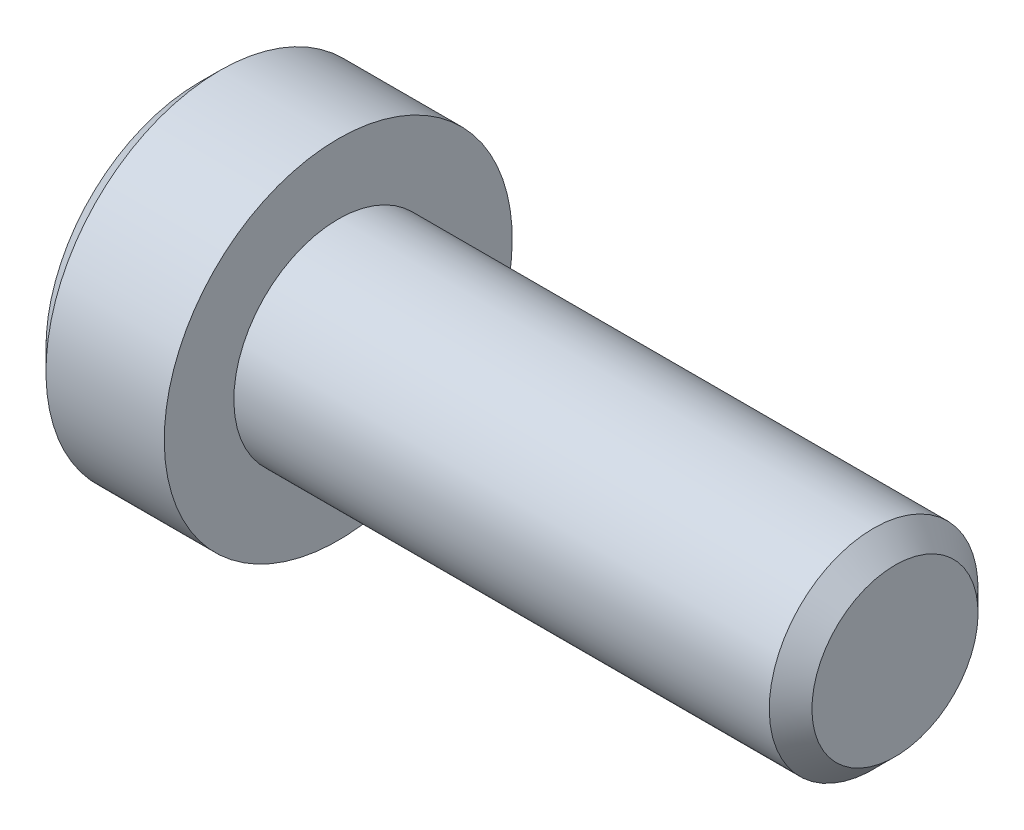
ISO-10303-21;
HEADER;
FILE_DESCRIPTION(('STEP AP214'),'2;1');
FILE_NAME('part.step','',(''),(''),'','','');
FILE_SCHEMA(('AUTOMOTIVE_DESIGN { 1 0 10303 214 1 1 1 1 }'));
ENDSEC;
DATA;
#1=APPLICATION_CONTEXT('core data for automotive mechanical design processes');
#2=APPLICATION_PROTOCOL_DEFINITION('international standard','automotive_design',2000,#1);
#3=PRODUCT_CONTEXT('',#1,'mechanical');
#4=PRODUCT('Part','Part','',(#3));
#5=PRODUCT_RELATED_PRODUCT_CATEGORY('part','',(#4));
#6=PRODUCT_DEFINITION_FORMATION('','',#4);
#7=PRODUCT_DEFINITION_CONTEXT('part definition',#1,'design');
#8=PRODUCT_DEFINITION('design','',#6,#7);
#9=PRODUCT_DEFINITION_SHAPE('','',#8);
#10=(LENGTH_UNIT() NAMED_UNIT(*) SI_UNIT(.MILLI.,.METRE.));
#11=(NAMED_UNIT(*) PLANE_ANGLE_UNIT() SI_UNIT($,.RADIAN.));
#12=(NAMED_UNIT(*) SI_UNIT($,.STERADIAN.) SOLID_ANGLE_UNIT());
#13=UNCERTAINTY_MEASURE_WITH_UNIT(LENGTH_MEASURE(1.E-05),#10,'distance_accuracy_value','');
#14=(GEOMETRIC_REPRESENTATION_CONTEXT(3) GLOBAL_UNCERTAINTY_ASSIGNED_CONTEXT((#13)) GLOBAL_UNIT_ASSIGNED_CONTEXT((#10,
#11,#12)) REPRESENTATION_CONTEXT('',''));
#15=CARTESIAN_POINT('',(0.,0.,0.));
#16=DIRECTION('',(0.,0.,1.));
#17=DIRECTION('',(1.,0.,0.));
#18=AXIS2_PLACEMENT_3D('',#15,#16,#17);
#19=CARTESIAN_POINT('',(1.00000000009004,0.,0.));
#20=DIRECTION('',(-1.,0.,0.));
#21=DIRECTION('',(0.,0.,1.));
#22=AXIS2_PLACEMENT_3D('',#19,#20,#21);
#23=CONICAL_SURFACE('',#22,1.499999999794,1.04719755099793);
#24=CARTESIAN_POINT('',(1.86602540384229,-1.13686837721616E-10,0.));
#25=VERTEX_POINT('',#24);
#26=VERTEX_LOOP('',#25);
#27=FACE_BOUND('',#26,.T.);
#28=CARTESIAN_POINT('',(1.,0.,0.));
#29=DIRECTION('',(1.,0.,0.));
#30=DIRECTION('',(0.,1.,0.));
#31=AXIS2_PLACEMENT_3D('',#28,#29,#30);
#32=CIRCLE('',#31,1.5);
#33=CARTESIAN_POINT('',(0.999999999988177,1.50000000001069,0.));
#34=VERTEX_POINT('',#33);
#35=EDGE_CURVE('E38',#34,#34,#32,.F.);
#36=ORIENTED_EDGE('',*,*,#35,.T.);
#37=EDGE_LOOP('',(#36));
#38=FACE_BOUND('',#37,.T.);
#39=ADVANCED_FACE('F16',(#27,#38),#23,.F.);
#40=CARTESIAN_POINT('',(0.150320631441119,0.,0.));
#41=DIRECTION('',(1.,0.,0.));
#42=DIRECTION('',(0.,1.,0.));
#43=AXIS2_PLACEMENT_3D('',#40,#41,#42);
#44=CYLINDRICAL_SURFACE('',#43,1.5);
#45=ORIENTED_EDGE('',*,*,#35,.F.);
#46=EDGE_LOOP('',(#45));
#47=FACE_BOUND('',#46,.T.);
#48=CARTESIAN_POINT('',(-0.699358737165312,0.,0.));
#49=DIRECTION('',(-1.,0.,0.));
#50=DIRECTION('',(0.,1.,0.));
#51=AXIS2_PLACEMENT_3D('',#48,#49,#50);
#52=CIRCLE('',#51,1.50000000002137);
#53=CARTESIAN_POINT('',(-0.69935873714154,1.50000000001069,0.));
#54=VERTEX_POINT('',#53);
#55=EDGE_CURVE('E89',#54,#54,#52,.T.);
#56=ORIENTED_EDGE('',*,*,#55,.T.);
#57=EDGE_LOOP('',(#56));
#58=FACE_BOUND('',#57,.T.);
#59=ADVANCED_FACE('F174',(#47,#58),#44,.F.);
#60=CARTESIAN_POINT('',(-1.50480384752427,0.,0.));
#61=DIRECTION('',(-1.,0.,0.));
#62=DIRECTION('',(0.,0.,1.));
#63=AXIS2_PLACEMENT_3D('',#60,#61,#62);
#64=CONICAL_SURFACE('',#63,2.89507185385673,1.04719755119689);
#65=ORIENTED_EDGE('',*,*,#55,.F.);
#66=EDGE_LOOP('',(#65));
#67=FACE_BOUND('',#66,.T.);
#68=CARTESIAN_POINT('',(-1.5000000000401,2.5,1.44337567296249));
#69=CARTESIAN_POINT('',(-1.46336943144872,2.5,1.31652043410511));
#70=CARTESIAN_POINT('',(-1.43005584641599,2.5,1.1885701826306));
#71=CARTESIAN_POINT('',(-1.3719079842917,2.5,0.930454306665635));
#72=CARTESIAN_POINT('',(-1.34709427546431,2.5,0.800284097448505));
#73=CARTESIAN_POINT('',(-1.30846994872495,2.5,0.541556813164133));
#74=CARTESIAN_POINT('',(-1.29440223453879,2.5,0.413039535454518));
#75=CARTESIAN_POINT('',(-1.27761146020631,2.5,0.155400579274322));
#76=CARTESIAN_POINT('',(-1.27487449251129,2.5,0.0262798366087439));
#77=CARTESIAN_POINT('',(-1.28058286273747,2.5,-0.214968419321009));
#78=CARTESIAN_POINT('',(-1.28762660656435,2.5,-0.327132133851389));
#79=CARTESIAN_POINT('',(-1.30994662594156,2.5,-0.550728852899093));
#80=CARTESIAN_POINT('',(-1.32523051850448,2.5,-0.662161084632299));
#81=CARTESIAN_POINT('',(-1.3634372917159,2.5,-0.886218434008018));
#82=CARTESIAN_POINT('',(-1.38652205281541,2.5,-0.998815208474608));
#83=CARTESIAN_POINT('',(-1.43891470109062,2.5,-1.222329862234));
#84=CARTESIAN_POINT('',(-1.46821028598106,2.5,-1.33325060279896));
#85=CARTESIAN_POINT('',(-1.5000000000401,2.5,-1.44337567296249));
#86=B_SPLINE_CURVE_WITH_KNOTS('',3,(#68,#69,#70,#71,#72,#73,#74,#75,#76,#77,#78,#79,#80,#81,#82,
#83,#84,#85),.UNSPECIFIED.,.F.,.F.,(4,2,2,2,2,2,2,2,4),(0.,0.396270014445231,0.793492271282188,
1.18088450768871,1.56780111111909,1.90463472828158,2.24178024222961,2.58640202809204,
2.93034746686955),.UNSPECIFIED.);
#87=CARTESIAN_POINT('',(-1.50000000004011,2.49999999999499,1.44337567297117));
#88=VERTEX_POINT('',#87);
#89=CARTESIAN_POINT('',(-1.50000000004178,2.5,-1.44337567296827));
#90=VERTEX_POINT('',#89);
#91=EDGE_CURVE('E19',#88,#90,#86,.T.);
#92=ORIENTED_EDGE('',*,*,#91,.T.);
#93=CARTESIAN_POINT('',(-1.5000000000401,2.49999999998997,-1.44337567297985));
#94=CARTESIAN_POINT('',(-1.46336943144872,2.39014014053634,-1.50680329240854));
#95=CARTESIAN_POINT('',(-1.43005584641599,2.27933197233881,-1.57077841814579));
#96=CARTESIAN_POINT('',(-1.3719079842917,2.05579706663307,-1.69983635612828));
#97=CARTESIAN_POINT('',(-1.34709427546431,1.9430663586351,-1.76492146073684));
#98=CARTESIAN_POINT('',(-1.30846994872495,1.71900195779268,-1.89428510287903));
#99=CARTESIAN_POINT('',(-1.29440223453879,1.60770273047093,-1.95854374173383));
#100=CARTESIAN_POINT('',(-1.27761146020631,1.38458084941438,-2.08736321982393));
#101=CARTESIAN_POINT('',(-1.27487449251129,1.27275900611047,-2.15192359115672));
#102=CARTESIAN_POINT('',(-1.28058286273746,1.06383188785662,-2.2725477191216));
#103=CARTESIAN_POINT('',(-1.28762660656435,0.966695261690483,-2.32862957638679));
#104=CARTESIAN_POINT('',(-1.30994662594155,0.773054822792319,-2.44042793591064));
#105=CARTESIAN_POINT('',(-1.32523051850448,0.676551679310968,-2.49614405177724));
#106=CARTESIAN_POINT('',(-1.3634372917159,0.48251232284699,-2.6081727264651));
#107=CARTESIAN_POINT('',(-1.38652205281541,0.385000655774736,-2.6644711136984));
#108=CARTESIAN_POINT('',(-1.43891470109062,0.191431287501019,-2.77622844057809));
#109=CARTESIAN_POINT('',(-1.46821028598105,0.0953711083651806,-2.83168881086057));
#110=CARTESIAN_POINT('',(-1.5000000000401,1.00237423278071E-11,-2.88675134594234));
#111=B_SPLINE_CURVE_WITH_KNOTS('',3,(#93,#94,#95,#96,#97,#98,#99,#100,#101,#102,#103,#104,#105,
#106,#107,#108,#109,#110),.UNSPECIFIED.,.F.,.F.,(4,2,2,2,2,2,2,2,4),(0.,0.39627001444523,
0.793492271282187,1.1808845076887,1.56780111111909,1.90463472828158,2.24178024222961,
2.58640202809204,2.93034746686955),.UNSPECIFIED.);
#112=CARTESIAN_POINT('',(-1.5000000000401,0.,-2.88675134594234));
#113=VERTEX_POINT('',#112);
#114=EDGE_CURVE('E115',#90,#113,#111,.T.);
#115=ORIENTED_EDGE('',*,*,#114,.T.);
#116=CARTESIAN_POINT('',(-1.50000000004011,-1.00280220844133E-11,-2.88675134594234));
#117=CARTESIAN_POINT('',(-1.46336943144872,-0.109859859463656,-2.82332372651365));
#118=CARTESIAN_POINT('',(-1.43005584641599,-0.220668027661191,-2.7593486007764));
#119=CARTESIAN_POINT('',(-1.3719079842917,-0.444202933366924,-2.63029066279391));
#120=CARTESIAN_POINT('',(-1.34709427546431,-0.556933641364894,-2.56520555818535));
#121=CARTESIAN_POINT('',(-1.30846994872495,-0.780998042207318,-2.43584191604316));
#122=CARTESIAN_POINT('',(-1.29440223453879,-0.892297269529065,-2.37158327718836));
#123=CARTESIAN_POINT('',(-1.27761146020631,-1.11541915058562,-2.24276379909826));
#124=CARTESIAN_POINT('',(-1.27487449251129,-1.22724099388952,-2.17820342776547));
#125=CARTESIAN_POINT('',(-1.28058286273747,-1.43616811214338,-2.05757929980059));
#126=CARTESIAN_POINT('',(-1.28762660656435,-1.53330473830951,-2.0014974425354));
#127=CARTESIAN_POINT('',(-1.30994662594156,-1.72694517720768,-1.88969908301155));
#128=CARTESIAN_POINT('',(-1.32523051850448,-1.82344832068903,-1.83398296714495));
#129=CARTESIAN_POINT('',(-1.3634372917159,-2.01748767715301,-1.72195429245709));
#130=CARTESIAN_POINT('',(-1.38652205281541,-2.11499934422526,-1.66565590522379));
#131=CARTESIAN_POINT('',(-1.43891470109062,-2.30856871249898,-1.5538985783441));
#132=CARTESIAN_POINT('',(-1.46821028598106,-2.40462889163482,-1.49843820806162));
#133=CARTESIAN_POINT('',(-1.50000000004011,-2.49999999998997,-1.44337567297986));
#134=B_SPLINE_CURVE_WITH_KNOTS('',3,(#116,#117,#118,#119,#120,#121,#122,#123,#124,#125,#126,
#127,#128,#129,#130,#131,#132,#133),.UNSPECIFIED.,.F.,.F.,(4,2,2,2,2,2,2,2,4),(0.,
0.396270014445231,0.793492271282189,1.18088450768871,1.56780111111909,1.90463472828158,
2.24178024222961,2.58640202809204,2.93034746686955),.UNSPECIFIED.);
#135=CARTESIAN_POINT('',(-1.50000000004011,-2.49999999999499,-1.44337567297117));
#136=VERTEX_POINT('',#135);
#137=EDGE_CURVE('E162',#113,#136,#134,.T.);
#138=ORIENTED_EDGE('',*,*,#137,.T.);
#139=CARTESIAN_POINT('',(-1.50000000004011,-2.5,-1.44337567296249));
#140=CARTESIAN_POINT('',(-1.46336943144872,-2.5,-1.31652043410512));
#141=CARTESIAN_POINT('',(-1.43005584641599,-2.5,-1.1885701826306));
#142=CARTESIAN_POINT('',(-1.3719079842917,-2.5,-0.93045430666564));
#143=CARTESIAN_POINT('',(-1.34709427546431,-2.5,-0.80028409744851));
#144=CARTESIAN_POINT('',(-1.30846994872495,-2.5,-0.541556813164138));
#145=CARTESIAN_POINT('',(-1.29440223453879,-2.5,-0.413039535454522));
#146=CARTESIAN_POINT('',(-1.27761146020631,-2.5,-0.155400579274326));
#147=CARTESIAN_POINT('',(-1.27487449251129,-2.5,-0.0262798366087479));
#148=CARTESIAN_POINT('',(-1.28058286273747,-2.5,0.214968419321006));
#149=CARTESIAN_POINT('',(-1.28762660656435,-2.5,0.327132133851387));
#150=CARTESIAN_POINT('',(-1.30994662594156,-2.5,0.550728852899093));
#151=CARTESIAN_POINT('',(-1.32523051850448,-2.5,0.662161084632299));
#152=CARTESIAN_POINT('',(-1.3634372917159,-2.5,0.88621843400802));
#153=CARTESIAN_POINT('',(-1.38652205281541,-2.5,0.998815208474612));
#154=CARTESIAN_POINT('',(-1.43891470109062,-2.5,1.22232986223401));
#155=CARTESIAN_POINT('',(-1.46821028598106,-2.5,1.33325060279897));
#156=CARTESIAN_POINT('',(-1.50000000004011,-2.5,1.44337567296249));
#157=B_SPLINE_CURVE_WITH_KNOTS('',3,(#139,#140,#141,#142,#143,#144,#145,#146,#147,#148,#149,
#150,#151,#152,#153,#154,#155,#156),.UNSPECIFIED.,.F.,.F.,(4,2,2,2,2,2,2,2,4),(0.,
0.396270014445231,0.793492271282189,1.18088450768871,1.56780111111909,1.90463472828159,
2.24178024222962,2.58640202809205,2.93034746686956),.UNSPECIFIED.);
#158=CARTESIAN_POINT('',(-1.50000000004011,-2.49999999999499,1.44337567297118));
#159=VERTEX_POINT('',#158);
#160=EDGE_CURVE('E188',#136,#159,#157,.T.);
#161=ORIENTED_EDGE('',*,*,#160,.T.);
#162=CARTESIAN_POINT('',(-1.50000000004011,-2.49999999998997,1.44337567297986));
#163=CARTESIAN_POINT('',(-1.46336943144872,-2.39014014053634,1.50680329240855));
#164=CARTESIAN_POINT('',(-1.430055846416,-2.27933197233881,1.5707784181458));
#165=CARTESIAN_POINT('',(-1.3719079842917,-2.05579706663308,1.69983635612828));
#166=CARTESIAN_POINT('',(-1.34709427546432,-1.94306635863511,1.76492146073685));
#167=CARTESIAN_POINT('',(-1.30846994872495,-1.71900195779268,1.89428510287904));
#168=CARTESIAN_POINT('',(-1.29440223453879,-1.60770273047094,1.95854374173384));
#169=CARTESIAN_POINT('',(-1.27761146020631,-1.38458084941438,2.08736321982394));
#170=CARTESIAN_POINT('',(-1.27487449251129,-1.27275900611048,2.15192359115673));
#171=CARTESIAN_POINT('',(-1.28058286273747,-1.06383188785662,2.27254771912161));
#172=CARTESIAN_POINT('',(-1.28762660656435,-0.966695261690485,2.3286295763868));
#173=CARTESIAN_POINT('',(-1.30994662594156,-0.773054822792322,2.44042793591065));
#174=CARTESIAN_POINT('',(-1.32523051850448,-0.676551679310971,2.49614405177725));
#175=CARTESIAN_POINT('',(-1.3634372917159,-0.482512322846993,2.60817272646511));
#176=CARTESIAN_POINT('',(-1.38652205281541,-0.385000655774739,2.66447111369841));
#177=CARTESIAN_POINT('',(-1.43891470109062,-0.191431287501023,2.7762284405781));
#178=CARTESIAN_POINT('',(-1.46821028598106,-0.095371108365185,2.83168881086058));
#179=CARTESIAN_POINT('',(-1.50000000004011,-1.00283522666756E-11,2.88675134594234));
#180=B_SPLINE_CURVE_WITH_KNOTS('',3,(#162,#163,#164,#165,#166,#167,#168,#169,#170,#171,#172,
#173,#174,#175,#176,#177,#178,#179),.UNSPECIFIED.,.F.,.F.,(4,2,2,2,2,2,2,2,4),(0.,
0.396270014445231,0.793492271282189,1.18088450768871,1.56780111111909,1.90463472828159,
2.24178024222961,2.58640202809204,2.93034746686955),.UNSPECIFIED.);
#181=CARTESIAN_POINT('',(-1.50000000004011,0.,2.88675134594234));
#182=VERTEX_POINT('',#181);
#183=EDGE_CURVE('E94',#159,#182,#180,.T.);
#184=ORIENTED_EDGE('',*,*,#183,.T.);
#185=CARTESIAN_POINT('',(-1.50000000004011,1.00254383973823E-11,2.88675134594234));
#186=CARTESIAN_POINT('',(-1.46336943144872,0.109859859463653,2.82332372651366));
#187=CARTESIAN_POINT('',(-1.43005584641599,0.220668027661188,2.7593486007764));
#188=CARTESIAN_POINT('',(-1.3719079842917,0.444202933366921,2.63029066279392));
#189=CARTESIAN_POINT('',(-1.34709427546431,0.556933641364891,2.56520555818535));
#190=CARTESIAN_POINT('',(-1.30846994872495,0.780998042207316,2.43584191604317));
#191=CARTESIAN_POINT('',(-1.29440223453879,0.892297269529062,2.37158327718836));
#192=CARTESIAN_POINT('',(-1.27761146020631,1.11541915058562,2.24276379909826));
#193=CARTESIAN_POINT('',(-1.27487449251129,1.22724099388952,2.17820342776547));
#194=CARTESIAN_POINT('',(-1.28058286273747,1.43616811214338,2.05757929980059));
#195=CARTESIAN_POINT('',(-1.28762660656435,1.53330473830951,2.0014974425354));
#196=CARTESIAN_POINT('',(-1.30994662594156,1.72694517720768,1.88969908301155));
#197=CARTESIAN_POINT('',(-1.32523051850448,1.82344832068903,1.83398296714495));
#198=CARTESIAN_POINT('',(-1.3634372917159,2.01748767715301,1.72195429245709));
#199=CARTESIAN_POINT('',(-1.38652205281541,2.11499934422526,1.66565590522379));
#200=CARTESIAN_POINT('',(-1.43891470109062,2.30856871249898,1.5538985783441));
#201=CARTESIAN_POINT('',(-1.46821028598106,2.40462889163482,1.49843820806162));
#202=CARTESIAN_POINT('',(-1.50000000004011,2.49999999998998,1.44337567297985));
#203=B_SPLINE_CURVE_WITH_KNOTS('',3,(#185,#186,#187,#188,#189,#190,#191,#192,#193,#194,#195,
#196,#197,#198,#199,#200,#201,#202),.UNSPECIFIED.,.F.,.F.,(4,2,2,2,2,2,2,2,4),(0.,
0.396270014445231,0.793492271282189,1.18088450768871,1.56780111111909,1.90463472828159,
2.24178024222961,2.58640202809204,2.93034746686955),.UNSPECIFIED.);
#204=EDGE_CURVE('E91',#182,#88,#203,.T.);
#205=ORIENTED_EDGE('',*,*,#204,.T.);
#206=EDGE_LOOP('',(#92,#115,#138,#161,#184,#205));
#207=FACE_BOUND('',#206,.T.);
#208=ADVANCED_FACE('F92',(#67,#207),#64,.F.);
#209=CARTESIAN_POINT('',(-4.,2.5,1.44337567297406));
#210=DIRECTION('',(0.,1.,0.));
#211=DIRECTION('',(0.,0.,1.));
#212=AXIS2_PLACEMENT_3D('',#209,#210,#211);
#213=PLANE('',#212);
#214=DIRECTION('',(1.,0.,0.));
#215=VECTOR('',#214,1.);
#216=CARTESIAN_POINT('',(-4.,2.5,1.44337567297406));
#217=LINE('',#216,#215);
#218=CARTESIAN_POINT('',(-4.,2.5,1.44337567297406));
#219=VERTEX_POINT('',#218);
#220=EDGE_CURVE('E82',#88,#219,#217,.F.);
#221=ORIENTED_EDGE('',*,*,#220,.T.);
#222=DIRECTION('',(0.,0.,1.));
#223=VECTOR('',#222,1.);
#224=CARTESIAN_POINT('',(-4.,2.5,0.));
#225=LINE('',#224,#223);
#226=CARTESIAN_POINT('',(-4.,2.5,-1.44337567297406));
#227=VERTEX_POINT('',#226);
#228=EDGE_CURVE('E113',#227,#219,#225,.T.);
#229=ORIENTED_EDGE('',*,*,#228,.F.);
#230=DIRECTION('',(1.,0.,0.));
#231=VECTOR('',#230,1.);
#232=CARTESIAN_POINT('',(-4.,2.5,-1.44337567297406));
#233=LINE('',#232,#231);
#234=EDGE_CURVE('E85',#227,#90,#233,.T.);
#235=ORIENTED_EDGE('',*,*,#234,.T.);
#236=ORIENTED_EDGE('',*,*,#91,.F.);
#237=EDGE_LOOP('',(#221,#229,#235,#236));
#238=FACE_BOUND('',#237,.T.);
#239=ADVANCED_FACE('F78',(#238),#213,.F.);
#240=CARTESIAN_POINT('',(-4.,0.,2.88675134594813));
#241=DIRECTION('',(0.,0.5,0.866025403784439));
#242=DIRECTION('',(0.,-0.866025403784439,0.5));
#243=AXIS2_PLACEMENT_3D('',#240,#241,#242);
#244=PLANE('',#243);
#245=DIRECTION('',(1.,0.,0.));
#246=VECTOR('',#245,1.);
#247=CARTESIAN_POINT('',(-4.,0.,2.88675134594813));
#248=LINE('',#247,#246);
#249=CARTESIAN_POINT('',(-4.,0.,2.88675134594813));
#250=VERTEX_POINT('',#249);
#251=EDGE_CURVE('E98',#182,#250,#248,.F.);
#252=ORIENTED_EDGE('',*,*,#251,.T.);
#253=DIRECTION('',(0.,-0.866025403784438,0.500000000000001));
#254=VECTOR('',#253,1.);
#255=CARTESIAN_POINT('',(-4.,2.5,1.44337567297406));
#256=LINE('',#255,#254);
#257=EDGE_CURVE('E101',#219,#250,#256,.T.);
#258=ORIENTED_EDGE('',*,*,#257,.F.);
#259=ORIENTED_EDGE('',*,*,#220,.F.);
#260=ORIENTED_EDGE('',*,*,#204,.F.);
#261=EDGE_LOOP('',(#252,#258,#259,#260));
#262=FACE_BOUND('',#261,.T.);
#263=ADVANCED_FACE('F99',(#262),#244,.F.);
#264=CARTESIAN_POINT('',(-4.,-2.5,1.44337567297407));
#265=DIRECTION('',(0.,-0.5,0.866025403784439));
#266=DIRECTION('',(0.,-0.866025403784439,-0.5));
#267=AXIS2_PLACEMENT_3D('',#264,#265,#266);
#268=PLANE('',#267);
#269=DIRECTION('',(1.,0.,0.));
#270=VECTOR('',#269,1.);
#271=CARTESIAN_POINT('',(-4.,-2.5,1.44337567297407));
#272=LINE('',#271,#270);
#273=CARTESIAN_POINT('',(-4.,-2.5,1.44337567297407));
#274=VERTEX_POINT('',#273);
#275=EDGE_CURVE('E199',#159,#274,#272,.F.);
#276=ORIENTED_EDGE('',*,*,#275,.T.);
#277=DIRECTION('',(0.,-0.866025403784439,-0.499999999999999));
#278=VECTOR('',#277,1.);
#279=CARTESIAN_POINT('',(-4.,0.,2.88675134594813));
#280=LINE('',#279,#278);
#281=EDGE_CURVE('E132',#250,#274,#280,.T.);
#282=ORIENTED_EDGE('',*,*,#281,.F.);
#283=ORIENTED_EDGE('',*,*,#251,.F.);
#284=ORIENTED_EDGE('',*,*,#183,.F.);
#285=EDGE_LOOP('',(#276,#282,#283,#284));
#286=FACE_BOUND('',#285,.T.);
#287=ADVANCED_FACE('F200',(#286),#268,.F.);
#288=CARTESIAN_POINT('',(-4.,-2.5,-1.44337567297406));
#289=DIRECTION('',(0.,-1.,0.));
#290=DIRECTION('',(0.,0.,-1.));
#291=AXIS2_PLACEMENT_3D('',#288,#289,#290);
#292=PLANE('',#291);
#293=DIRECTION('',(1.,0.,0.));
#294=VECTOR('',#293,1.);
#295=CARTESIAN_POINT('',(-4.,-2.5,-1.44337567297407));
#296=LINE('',#295,#294);
#297=CARTESIAN_POINT('',(-4.,-2.5,-1.44337567297406));
#298=VERTEX_POINT('',#297);
#299=EDGE_CURVE('E269',#136,#298,#296,.F.);
#300=ORIENTED_EDGE('',*,*,#299,.T.);
#301=DIRECTION('',(0.,0.,1.));
#302=VECTOR('',#301,1.);
#303=CARTESIAN_POINT('',(-4.,-2.5,0.));
#304=LINE('',#303,#302);
#305=EDGE_CURVE('E127',#274,#298,#304,.F.);
#306=ORIENTED_EDGE('',*,*,#305,.F.);
#307=ORIENTED_EDGE('',*,*,#275,.F.);
#308=ORIENTED_EDGE('',*,*,#160,.F.);
#309=EDGE_LOOP('',(#300,#306,#307,#308));
#310=FACE_BOUND('',#309,.T.);
#311=ADVANCED_FACE('F203',(#310),#292,.F.);
#312=CARTESIAN_POINT('',(-4.,0.,-2.88675134594813));
#313=DIRECTION('',(0.,-0.5,-0.866025403784439));
#314=DIRECTION('',(0.,0.866025403784439,-0.5));
#315=AXIS2_PLACEMENT_3D('',#312,#313,#314);
#316=PLANE('',#315);
#317=DIRECTION('',(1.,0.,0.));
#318=VECTOR('',#317,1.);
#319=CARTESIAN_POINT('',(-4.,0.,-2.88675134594813));
#320=LINE('',#319,#318);
#321=CARTESIAN_POINT('',(-4.,0.,-2.88675134594813));
#322=VERTEX_POINT('',#321);
#323=EDGE_CURVE('E262',#113,#322,#320,.F.);
#324=ORIENTED_EDGE('',*,*,#323,.T.);
#325=DIRECTION('',(0.,0.866025403784438,-0.500000000000001));
#326=VECTOR('',#325,1.);
#327=CARTESIAN_POINT('',(-4.,-2.5,-1.44337567297406));
#328=LINE('',#327,#326);
#329=EDGE_CURVE('E122',#298,#322,#328,.T.);
#330=ORIENTED_EDGE('',*,*,#329,.F.);
#331=ORIENTED_EDGE('',*,*,#299,.F.);
#332=ORIENTED_EDGE('',*,*,#137,.F.);
#333=EDGE_LOOP('',(#324,#330,#331,#332));
#334=FACE_BOUND('',#333,.T.);
#335=ADVANCED_FACE('F245',(#334),#316,.F.);
#336=CARTESIAN_POINT('',(-4.,2.5,-1.44337567297406));
#337=DIRECTION('',(0.,0.5,-0.866025403784439));
#338=DIRECTION('',(0.,0.866025403784439,0.5));
#339=AXIS2_PLACEMENT_3D('',#336,#337,#338);
#340=PLANE('',#339);
#341=ORIENTED_EDGE('',*,*,#234,.F.);
#342=DIRECTION('',(0.,0.866025403784438,0.500000000000001));
#343=VECTOR('',#342,1.);
#344=CARTESIAN_POINT('',(-4.,0.,-2.88675134594813));
#345=LINE('',#344,#343);
#346=EDGE_CURVE('E118',#322,#227,#345,.T.);
#347=ORIENTED_EDGE('',*,*,#346,.F.);
#348=ORIENTED_EDGE('',*,*,#323,.F.);
#349=ORIENTED_EDGE('',*,*,#114,.F.);
#350=EDGE_LOOP('',(#341,#347,#348,#349));
#351=FACE_BOUND('',#350,.T.);
#352=ADVANCED_FACE('F169',(#351),#340,.F.);
#353=CARTESIAN_POINT('',(-4.,3.94337567297406,0.));
#354=DIRECTION('',(-1.,0.,0.));
#355=DIRECTION('',(0.,-1.,0.));
#356=AXIS2_PLACEMENT_3D('',#353,#354,#355);
#357=PLANE('',#356);
#358=ORIENTED_EDGE('',*,*,#329,.T.);
#359=ORIENTED_EDGE('',*,*,#346,.T.);
#360=ORIENTED_EDGE('',*,*,#228,.T.);
#361=ORIENTED_EDGE('',*,*,#257,.T.);
#362=ORIENTED_EDGE('',*,*,#281,.T.);
#363=ORIENTED_EDGE('',*,*,#305,.T.);
#364=EDGE_LOOP('',(#358,#359,#360,#361,#362,#363));
#365=FACE_BOUND('',#364,.T.);
#366=CARTESIAN_POINT('',(-3.99999999996226,0.,0.));
#367=DIRECTION('',(1.,0.,0.));
#368=DIRECTION('',(0.,0.,-1.));
#369=AXIS2_PLACEMENT_3D('',#366,#367,#368);
#370=CIRCLE('',#369,4.39999999997553);
#371=CARTESIAN_POINT('',(-3.99999999996226,4.39999999997553,0.));
#372=VERTEX_POINT('',#371);
#373=EDGE_CURVE('E121',#372,#372,#370,.T.);
#374=ORIENTED_EDGE('',*,*,#373,.F.);
#375=EDGE_LOOP('',(#374));
#376=FACE_BOUND('',#375,.T.);
#377=ADVANCED_FACE('F238',(#365,#376),#357,.T.);
#378=CARTESIAN_POINT('',(-3.39999999999918,0.,0.));
#379=DIRECTION('',(1.,0.,0.));
#380=DIRECTION('',(0.,0.,-1.));
#381=AXIS2_PLACEMENT_3D('',#378,#379,#380);
#382=CONICAL_SURFACE('',#381,4.99999999993861,0.785398163397448);
#383=ORIENTED_EDGE('',*,*,#373,.T.);
#384=EDGE_LOOP('',(#383));
#385=FACE_BOUND('',#384,.T.);
#386=CARTESIAN_POINT('',(-3.39999999999999,0.,0.));
#387=DIRECTION('',(1.,0.,0.));
#388=DIRECTION('',(0.,1.,0.));
#389=AXIS2_PLACEMENT_3D('',#386,#387,#388);
#390=CIRCLE('',#389,5.);
#391=CARTESIAN_POINT('',(-3.39999999997116,4.99999999999773,0.));
#392=VERTEX_POINT('',#391);
#393=EDGE_CURVE('E153',#392,#392,#390,.T.);
#394=ORIENTED_EDGE('',*,*,#393,.F.);
#395=EDGE_LOOP('',(#394));
#396=FACE_BOUND('',#395,.T.);
#397=ADVANCED_FACE('F235',(#385,#396),#382,.T.);
#398=CARTESIAN_POINT('',(-2.,0.,0.));
#399=DIRECTION('',(1.,0.,0.));
#400=DIRECTION('',(0.,1.,0.));
#401=AXIS2_PLACEMENT_3D('',#398,#399,#400);
#402=CYLINDRICAL_SURFACE('',#401,5.);
#403=CARTESIAN_POINT('',(0.,0.,0.));
#404=DIRECTION('',(1.,0.,0.));
#405=DIRECTION('',(0.,1.,0.));
#406=AXIS2_PLACEMENT_3D('',#403,#404,#405);
#407=CIRCLE('',#406,5.);
#408=CARTESIAN_POINT('',(0.,5.,0.));
#409=VERTEX_POINT('',#408);
#410=EDGE_CURVE('E150',#409,#409,#407,.T.);
#411=ORIENTED_EDGE('',*,*,#410,.F.);
#412=EDGE_LOOP('',(#411));
#413=FACE_BOUND('',#412,.T.);
#414=ORIENTED_EDGE('',*,*,#393,.T.);
#415=EDGE_LOOP('',(#414));
#416=FACE_BOUND('',#415,.T.);
#417=ADVANCED_FACE('F231',(#413,#416),#402,.T.);
#418=CARTESIAN_POINT('',(16.,1.5,0.));
#419=DIRECTION('',(1.,0.,0.));
#420=DIRECTION('',(0.,1.,0.));
#421=AXIS2_PLACEMENT_3D('',#418,#419,#420);
#422=PLANE('',#421);
#423=CARTESIAN_POINT('',(15.9999999999627,0.,0.));
#424=DIRECTION('',(-1.,0.,0.));
#425=DIRECTION('',(0.,0.,1.));
#426=AXIS2_PLACEMENT_3D('',#423,#424,#425);
#427=CIRCLE('',#426,2.38654999998289);
#428=CARTESIAN_POINT('',(15.9999999999627,2.38654999998289,0.));
#429=VERTEX_POINT('',#428);
#430=EDGE_CURVE('E147',#429,#429,#427,.T.);
#431=ORIENTED_EDGE('',*,*,#430,.F.);
#432=EDGE_LOOP('',(#431));
#433=FACE_BOUND('',#432,.T.);
#434=ADVANCED_FACE('F227',(#433),#422,.T.);
#435=CARTESIAN_POINT('',(0.,4.,0.));
#436=DIRECTION('',(1.,0.,0.));
#437=DIRECTION('',(0.,1.,0.));
#438=AXIS2_PLACEMENT_3D('',#435,#436,#437);
#439=PLANE('',#438);
#440=CARTESIAN_POINT('',(0.,0.,0.));
#441=DIRECTION('',(1.,0.,0.));
#442=DIRECTION('',(0.,1.,0.));
#443=AXIS2_PLACEMENT_3D('',#440,#441,#442);
#444=CIRCLE('',#443,3.);
#445=CARTESIAN_POINT('',(0.,3.,0.));
#446=VERTEX_POINT('',#445);
#447=EDGE_CURVE('E31',#446,#446,#444,.T.);
#448=ORIENTED_EDGE('',*,*,#447,.F.);
#449=EDGE_LOOP('',(#448));
#450=FACE_BOUND('',#449,.T.);
#451=ORIENTED_EDGE('',*,*,#410,.T.);
#452=EDGE_LOOP('',(#451));
#453=FACE_BOUND('',#452,.T.);
#454=ADVANCED_FACE('F220',(#450,#453),#439,.T.);
#455=CARTESIAN_POINT('',(15.3865500000165,0.,0.));
#456=DIRECTION('',(-1.,0.,0.));
#457=DIRECTION('',(0.,0.,1.));
#458=AXIS2_PLACEMENT_3D('',#455,#456,#457);
#459=CONICAL_SURFACE('',#458,2.99999999992906,0.785398163397448);
#460=ORIENTED_EDGE('',*,*,#430,.T.);
#461=EDGE_LOOP('',(#460));
#462=FACE_BOUND('',#461,.T.);
#463=CARTESIAN_POINT('',(15.38655,0.,0.));
#464=DIRECTION('',(1.,0.,0.));
#465=DIRECTION('',(0.,1.,0.));
#466=AXIS2_PLACEMENT_3D('',#463,#464,#465);
#467=CIRCLE('',#466,3.);
#468=CARTESIAN_POINT('',(15.3865500000083,2.99999999996453,0.));
#469=VERTEX_POINT('',#468);
#470=EDGE_CURVE('E11',#469,#469,#467,.F.);
#471=ORIENTED_EDGE('',*,*,#470,.F.);
#472=EDGE_LOOP('',(#471));
#473=FACE_BOUND('',#472,.T.);
#474=ADVANCED_FACE('F214',(#462,#473),#459,.T.);
#475=CARTESIAN_POINT('',(8.,0.,0.));
#476=DIRECTION('',(1.,0.,0.));
#477=DIRECTION('',(0.,1.,0.));
#478=AXIS2_PLACEMENT_3D('',#475,#476,#477);
#479=CYLINDRICAL_SURFACE('',#478,3.);
#480=ORIENTED_EDGE('',*,*,#470,.T.);
#481=EDGE_LOOP('',(#480));
#482=FACE_BOUND('',#481,.T.);
#483=ORIENTED_EDGE('',*,*,#447,.T.);
#484=EDGE_LOOP('',(#483));
#485=FACE_BOUND('',#484,.T.);
#486=ADVANCED_FACE('F212',(#482,#485),#479,.T.);
#487=CLOSED_SHELL('',(#39,#59,#208,#239,#263,#287,#311,#335,#352,#377,#397,#417,#434,#454,#474,#486));
#488=MANIFOLD_SOLID_BREP('B1',#487);
#489=ADVANCED_BREP_SHAPE_REPRESENTATION('',(#18,#488),#14);
#490=SHAPE_DEFINITION_REPRESENTATION(#9,#489);
ENDSEC;
END-ISO-10303-21;
